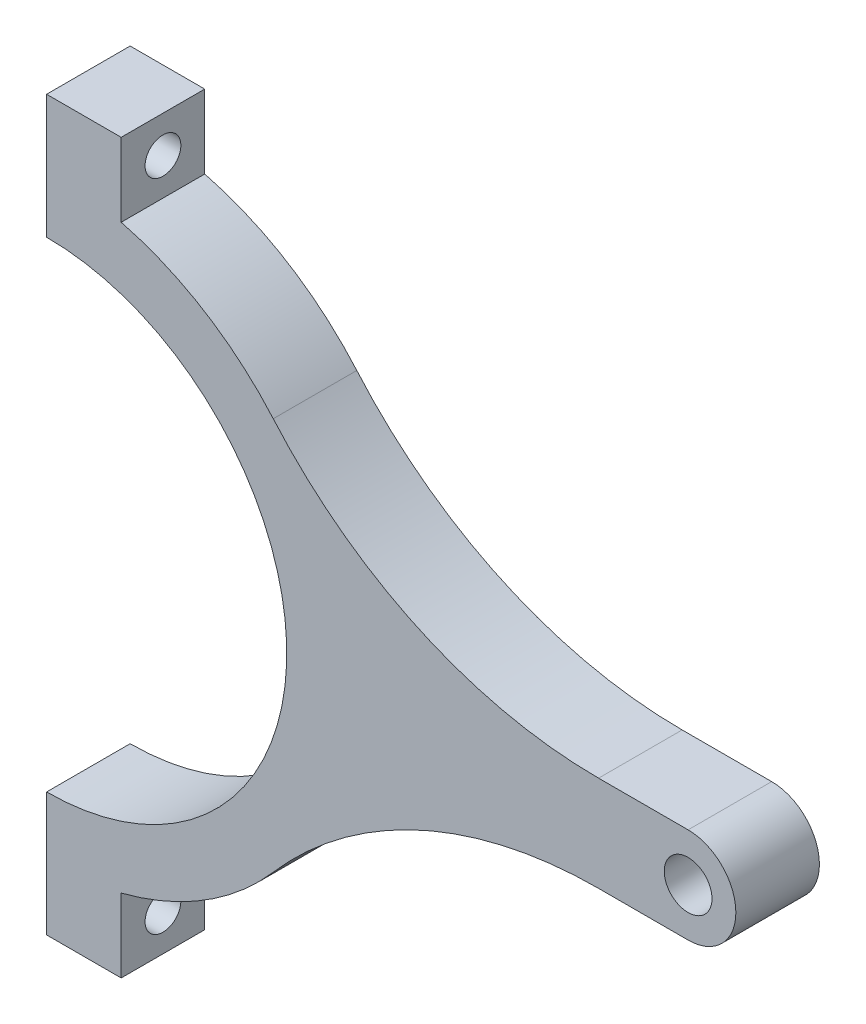
ISO-10303-21;
HEADER;
FILE_DESCRIPTION(('STEP AP214'),'2;1');
FILE_NAME('part.step','',(''),(''),'','','');
FILE_SCHEMA(('AUTOMOTIVE_DESIGN { 1 0 10303 214 1 1 1 1 }'));
ENDSEC;
DATA;
#1=APPLICATION_CONTEXT('core data for automotive mechanical design processes');
#2=APPLICATION_PROTOCOL_DEFINITION('international standard','automotive_design',2000,#1);
#3=PRODUCT_CONTEXT('',#1,'mechanical');
#4=PRODUCT('Part','Part','',(#3));
#5=PRODUCT_RELATED_PRODUCT_CATEGORY('part','',(#4));
#6=PRODUCT_DEFINITION_FORMATION('','',#4);
#7=PRODUCT_DEFINITION_CONTEXT('part definition',#1,'design');
#8=PRODUCT_DEFINITION('design','',#6,#7);
#9=PRODUCT_DEFINITION_SHAPE('','',#8);
#10=(LENGTH_UNIT() NAMED_UNIT(*) SI_UNIT(.MILLI.,.METRE.));
#11=(NAMED_UNIT(*) PLANE_ANGLE_UNIT() SI_UNIT($,.RADIAN.));
#12=(NAMED_UNIT(*) SI_UNIT($,.STERADIAN.) SOLID_ANGLE_UNIT());
#13=UNCERTAINTY_MEASURE_WITH_UNIT(LENGTH_MEASURE(1.E-05),#10,'distance_accuracy_value','');
#14=(GEOMETRIC_REPRESENTATION_CONTEXT(3) GLOBAL_UNCERTAINTY_ASSIGNED_CONTEXT((#13)) GLOBAL_UNIT_ASSIGNED_CONTEXT((#10,
#11,#12)) REPRESENTATION_CONTEXT('',''));
#15=CARTESIAN_POINT('',(0.,0.,0.));
#16=DIRECTION('',(0.,0.,1.));
#17=DIRECTION('',(1.,0.,0.));
#18=AXIS2_PLACEMENT_3D('',#15,#16,#17);
#19=CARTESIAN_POINT('',(0.,0.,28.));
#20=DIRECTION('',(0.,0.,-1.));
#21=DIRECTION('',(-1.,0.,0.));
#22=AXIS2_PLACEMENT_3D('',#19,#20,#21);
#23=PLANE('',#22);
#24=CARTESIAN_POINT('',(0.,0.,28.));
#25=DIRECTION('',(0.,0.,-1.));
#26=DIRECTION('',(-1.,0.,0.));
#27=AXIS2_PLACEMENT_3D('',#24,#25,#26);
#28=CIRCLE('',#27,80.5);
#29=CARTESIAN_POINT('',(0.,80.5,28.));
#30=VERTEX_POINT('',#29);
#31=CARTESIAN_POINT('',(0.,-80.5,28.));
#32=VERTEX_POINT('',#31);
#33=EDGE_CURVE('E197',#30,#32,#28,.T.);
#34=ORIENTED_EDGE('',*,*,#33,.T.);
#35=DIRECTION('',(0.,-1.,0.));
#36=VECTOR('',#35,1.);
#37=CARTESIAN_POINT('',(0.,-122.,28.));
#38=LINE('',#37,#36);
#39=CARTESIAN_POINT('',(0.,-122.,28.));
#40=VERTEX_POINT('',#39);
#41=EDGE_CURVE('E115',#32,#40,#38,.T.);
#42=ORIENTED_EDGE('',*,*,#41,.T.);
#43=DIRECTION('',(1.,0.,0.));
#44=VECTOR('',#43,1.);
#45=CARTESIAN_POINT('',(0.,-122.,28.));
#46=LINE('',#45,#44);
#47=CARTESIAN_POINT('',(25.,-122.,28.));
#48=VERTEX_POINT('',#47);
#49=EDGE_CURVE('E231',#40,#48,#46,.T.);
#50=ORIENTED_EDGE('',*,*,#49,.T.);
#51=DIRECTION('',(0.,1.,0.));
#52=VECTOR('',#51,1.);
#53=CARTESIAN_POINT('',(25.,-122.,28.));
#54=LINE('',#53,#52);
#55=CARTESIAN_POINT('',(25.,-97.3408958249306,28.));
#56=VERTEX_POINT('',#55);
#57=EDGE_CURVE('E250',#48,#56,#54,.T.);
#58=ORIENTED_EDGE('',*,*,#57,.T.);
#59=CARTESIAN_POINT('',(0.,0.,28.));
#60=DIRECTION('',(0.,0.,1.));
#61=DIRECTION('',(-1.,0.,0.));
#62=AXIS2_PLACEMENT_3D('',#59,#60,#61);
#63=CIRCLE('',#62,100.5);
#64=CARTESIAN_POINT('',(75.9606795559074,-65.8044463650045,28.));
#65=VERTEX_POINT('',#64);
#66=EDGE_CURVE('E247',#56,#65,#63,.T.);
#67=ORIENTED_EDGE('',*,*,#66,.T.);
#68=CARTESIAN_POINT('',(185.,-160.264792899408,28.));
#69=DIRECTION('',(0.,0.,-1.));
#70=DIRECTION('',(-1.,0.,0.));
#71=AXIS2_PLACEMENT_3D('',#68,#69,#70);
#72=CIRCLE('',#71,144.264792899408);
#73=CARTESIAN_POINT('',(185.,-16.,28.));
#74=VERTEX_POINT('',#73);
#75=EDGE_CURVE('E249',#65,#74,#72,.T.);
#76=ORIENTED_EDGE('',*,*,#75,.T.);
#77=DIRECTION('',(1.,0.,0.));
#78=VECTOR('',#77,1.);
#79=CARTESIAN_POINT('',(215.,-16.,28.));
#80=LINE('',#79,#78);
#81=CARTESIAN_POINT('',(215.,-16.,28.));
#82=VERTEX_POINT('',#81);
#83=EDGE_CURVE('E252',#74,#82,#80,.T.);
#84=ORIENTED_EDGE('',*,*,#83,.T.);
#85=CARTESIAN_POINT('',(215.,0.,28.));
#86=DIRECTION('',(0.,0.,1.));
#87=DIRECTION('',(1.,0.,0.));
#88=AXIS2_PLACEMENT_3D('',#85,#86,#87);
#89=CIRCLE('',#88,16.);
#90=CARTESIAN_POINT('',(215.,16.,28.));
#91=VERTEX_POINT('',#90);
#92=EDGE_CURVE('E258',#82,#91,#89,.T.);
#93=ORIENTED_EDGE('',*,*,#92,.T.);
#94=DIRECTION('',(-1.,0.,0.));
#95=VECTOR('',#94,1.);
#96=CARTESIAN_POINT('',(215.,16.,28.));
#97=LINE('',#96,#95);
#98=CARTESIAN_POINT('',(185.,16.,28.));
#99=VERTEX_POINT('',#98);
#100=EDGE_CURVE('E260',#91,#99,#97,.T.);
#101=ORIENTED_EDGE('',*,*,#100,.T.);
#102=CARTESIAN_POINT('',(185.,160.264792899408,28.));
#103=DIRECTION('',(0.,0.,-1.));
#104=DIRECTION('',(1.,0.,0.));
#105=AXIS2_PLACEMENT_3D('',#102,#103,#104);
#106=CIRCLE('',#105,144.264792899408);
#107=CARTESIAN_POINT('',(75.9606795559074,65.8044463650045,28.));
#108=VERTEX_POINT('',#107);
#109=EDGE_CURVE('E262',#99,#108,#106,.T.);
#110=ORIENTED_EDGE('',*,*,#109,.T.);
#111=CARTESIAN_POINT('',(0.,0.,28.));
#112=DIRECTION('',(0.,0.,1.));
#113=DIRECTION('',(-1.,0.,0.));
#114=AXIS2_PLACEMENT_3D('',#111,#112,#113);
#115=CIRCLE('',#114,100.5);
#116=CARTESIAN_POINT('',(25.,97.3408958249307,28.));
#117=VERTEX_POINT('',#116);
#118=EDGE_CURVE('E152',#108,#117,#115,.T.);
#119=ORIENTED_EDGE('',*,*,#118,.T.);
#120=DIRECTION('',(0.,1.,0.));
#121=VECTOR('',#120,1.);
#122=CARTESIAN_POINT('',(25.,122.,28.));
#123=LINE('',#122,#121);
#124=CARTESIAN_POINT('',(25.,122.,28.));
#125=VERTEX_POINT('',#124);
#126=EDGE_CURVE('E146',#117,#125,#123,.T.);
#127=ORIENTED_EDGE('',*,*,#126,.T.);
#128=DIRECTION('',(-1.,0.,0.));
#129=VECTOR('',#128,1.);
#130=CARTESIAN_POINT('',(0.,122.,28.));
#131=LINE('',#130,#129);
#132=CARTESIAN_POINT('',(0.,122.,28.));
#133=VERTEX_POINT('',#132);
#134=EDGE_CURVE('E150',#125,#133,#131,.T.);
#135=ORIENTED_EDGE('',*,*,#134,.T.);
#136=DIRECTION('',(0.,-1.,0.));
#137=VECTOR('',#136,1.);
#138=CARTESIAN_POINT('',(0.,80.5,28.));
#139=LINE('',#138,#137);
#140=EDGE_CURVE('E54',#133,#30,#139,.T.);
#141=ORIENTED_EDGE('',*,*,#140,.T.);
#142=EDGE_LOOP('',(#34,#42,#50,#58,#67,#76,#84,#93,#101,#110,#119,#127,#135,#141));
#143=FACE_BOUND('',#142,.T.);
#144=CARTESIAN_POINT('',(215.,0.,28.));
#145=DIRECTION('',(0.,0.,1.));
#146=DIRECTION('',(1.,0.,0.));
#147=AXIS2_PLACEMENT_3D('',#144,#145,#146);
#148=CIRCLE('',#147,8.00000000000001);
#149=CARTESIAN_POINT('',(223.,0.,28.));
#150=VERTEX_POINT('',#149);
#151=EDGE_CURVE('E174',#150,#150,#148,.T.);
#152=ORIENTED_EDGE('',*,*,#151,.F.);
#153=EDGE_LOOP('',(#152));
#154=FACE_BOUND('',#153,.T.);
#155=ADVANCED_FACE('F36',(#143,#154),#23,.F.);
#156=CARTESIAN_POINT('',(0.,0.,0.));
#157=DIRECTION('',(0.,0.,-1.));
#158=DIRECTION('',(-1.,0.,0.));
#159=AXIS2_PLACEMENT_3D('',#156,#157,#158);
#160=PLANE('',#159);
#161=CARTESIAN_POINT('',(0.,0.,0.));
#162=DIRECTION('',(0.,0.,-1.));
#163=DIRECTION('',(-1.,0.,0.));
#164=AXIS2_PLACEMENT_3D('',#161,#162,#163);
#165=CIRCLE('',#164,80.5);
#166=CARTESIAN_POINT('',(0.,80.5,0.));
#167=VERTEX_POINT('',#166);
#168=CARTESIAN_POINT('',(0.,-80.5,0.));
#169=VERTEX_POINT('',#168);
#170=EDGE_CURVE('E170',#167,#169,#165,.T.);
#171=ORIENTED_EDGE('',*,*,#170,.F.);
#172=DIRECTION('',(0.,-1.,0.));
#173=VECTOR('',#172,1.);
#174=CARTESIAN_POINT('',(0.,80.5,0.));
#175=LINE('',#174,#173);
#176=CARTESIAN_POINT('',(0.,122.,0.));
#177=VERTEX_POINT('',#176);
#178=EDGE_CURVE('E107',#177,#167,#175,.T.);
#179=ORIENTED_EDGE('',*,*,#178,.F.);
#180=DIRECTION('',(-1.,0.,0.));
#181=VECTOR('',#180,1.);
#182=CARTESIAN_POINT('',(0.,122.,0.));
#183=LINE('',#182,#181);
#184=CARTESIAN_POINT('',(25.,122.,0.));
#185=VERTEX_POINT('',#184);
#186=EDGE_CURVE('E101',#185,#177,#183,.T.);
#187=ORIENTED_EDGE('',*,*,#186,.F.);
#188=DIRECTION('',(0.,1.,0.));
#189=VECTOR('',#188,1.);
#190=CARTESIAN_POINT('',(25.,122.,0.));
#191=LINE('',#190,#189);
#192=CARTESIAN_POINT('',(25.,97.3408958249307,0.));
#193=VERTEX_POINT('',#192);
#194=EDGE_CURVE('E160',#193,#185,#191,.T.);
#195=ORIENTED_EDGE('',*,*,#194,.F.);
#196=CARTESIAN_POINT('',(0.,0.,0.));
#197=DIRECTION('',(0.,0.,1.));
#198=DIRECTION('',(-1.,0.,0.));
#199=AXIS2_PLACEMENT_3D('',#196,#197,#198);
#200=CIRCLE('',#199,100.5);
#201=CARTESIAN_POINT('',(75.9606795559074,65.8044463650045,0.));
#202=VERTEX_POINT('',#201);
#203=EDGE_CURVE('E192',#202,#193,#200,.T.);
#204=ORIENTED_EDGE('',*,*,#203,.F.);
#205=CARTESIAN_POINT('',(185.,160.264792899408,0.));
#206=DIRECTION('',(0.,0.,-1.));
#207=DIRECTION('',(1.,0.,0.));
#208=AXIS2_PLACEMENT_3D('',#205,#206,#207);
#209=CIRCLE('',#208,144.264792899408);
#210=CARTESIAN_POINT('',(185.,16.,0.));
#211=VERTEX_POINT('',#210);
#212=EDGE_CURVE('E190',#211,#202,#209,.T.);
#213=ORIENTED_EDGE('',*,*,#212,.F.);
#214=DIRECTION('',(-1.,0.,0.));
#215=VECTOR('',#214,1.);
#216=CARTESIAN_POINT('',(215.,16.,0.));
#217=LINE('',#216,#215);
#218=CARTESIAN_POINT('',(215.,16.,0.));
#219=VERTEX_POINT('',#218);
#220=EDGE_CURVE('E188',#219,#211,#217,.T.);
#221=ORIENTED_EDGE('',*,*,#220,.F.);
#222=CARTESIAN_POINT('',(215.,0.,0.));
#223=DIRECTION('',(0.,0.,1.));
#224=DIRECTION('',(1.,0.,0.));
#225=AXIS2_PLACEMENT_3D('',#222,#223,#224);
#226=CIRCLE('',#225,16.);
#227=CARTESIAN_POINT('',(215.,-16.,0.));
#228=VERTEX_POINT('',#227);
#229=EDGE_CURVE('E186',#228,#219,#226,.T.);
#230=ORIENTED_EDGE('',*,*,#229,.F.);
#231=DIRECTION('',(1.,0.,0.));
#232=VECTOR('',#231,1.);
#233=CARTESIAN_POINT('',(215.,-16.,0.));
#234=LINE('',#233,#232);
#235=CARTESIAN_POINT('',(185.,-16.,0.));
#236=VERTEX_POINT('',#235);
#237=EDGE_CURVE('E184',#236,#228,#234,.T.);
#238=ORIENTED_EDGE('',*,*,#237,.F.);
#239=CARTESIAN_POINT('',(185.,-160.264792899408,0.));
#240=DIRECTION('',(0.,0.,-1.));
#241=DIRECTION('',(-1.,0.,0.));
#242=AXIS2_PLACEMENT_3D('',#239,#240,#241);
#243=CIRCLE('',#242,144.264792899408);
#244=CARTESIAN_POINT('',(75.9606795559074,-65.8044463650045,0.));
#245=VERTEX_POINT('',#244);
#246=EDGE_CURVE('E182',#245,#236,#243,.T.);
#247=ORIENTED_EDGE('',*,*,#246,.F.);
#248=CARTESIAN_POINT('',(0.,0.,0.));
#249=DIRECTION('',(0.,0.,1.));
#250=DIRECTION('',(-1.,0.,0.));
#251=AXIS2_PLACEMENT_3D('',#248,#249,#250);
#252=CIRCLE('',#251,100.5);
#253=CARTESIAN_POINT('',(25.,-97.3408958249306,0.));
#254=VERTEX_POINT('',#253);
#255=EDGE_CURVE('E180',#254,#245,#252,.T.);
#256=ORIENTED_EDGE('',*,*,#255,.F.);
#257=DIRECTION('',(0.,1.,0.));
#258=VECTOR('',#257,1.);
#259=CARTESIAN_POINT('',(25.,-122.,0.));
#260=LINE('',#259,#258);
#261=CARTESIAN_POINT('',(25.,-122.,0.));
#262=VERTEX_POINT('',#261);
#263=EDGE_CURVE('E178',#262,#254,#260,.T.);
#264=ORIENTED_EDGE('',*,*,#263,.F.);
#265=DIRECTION('',(1.,0.,0.));
#266=VECTOR('',#265,1.);
#267=CARTESIAN_POINT('',(0.,-122.,0.));
#268=LINE('',#267,#266);
#269=CARTESIAN_POINT('',(0.,-122.,0.));
#270=VERTEX_POINT('',#269);
#271=EDGE_CURVE('E176',#270,#262,#268,.T.);
#272=ORIENTED_EDGE('',*,*,#271,.F.);
#273=DIRECTION('',(0.,-1.,0.));
#274=VECTOR('',#273,1.);
#275=CARTESIAN_POINT('',(0.,-122.,0.));
#276=LINE('',#275,#274);
#277=EDGE_CURVE('E173',#169,#270,#276,.T.);
#278=ORIENTED_EDGE('',*,*,#277,.F.);
#279=EDGE_LOOP('',(#171,#179,#187,#195,#204,#213,#221,#230,#238,#247,#256,#264,#272,#278));
#280=FACE_BOUND('',#279,.T.);
#281=CARTESIAN_POINT('',(215.,0.,0.));
#282=DIRECTION('',(0.,0.,1.));
#283=DIRECTION('',(1.,0.,0.));
#284=AXIS2_PLACEMENT_3D('',#281,#282,#283);
#285=CIRCLE('',#284,8.00000000000001);
#286=CARTESIAN_POINT('',(223.,0.,0.));
#287=VERTEX_POINT('',#286);
#288=EDGE_CURVE('E314',#287,#287,#285,.T.);
#289=ORIENTED_EDGE('',*,*,#288,.T.);
#290=EDGE_LOOP('',(#289));
#291=FACE_BOUND('',#290,.T.);
#292=ADVANCED_FACE('F235',(#280,#291),#160,.T.);
#293=CARTESIAN_POINT('',(0.,0.,28.));
#294=DIRECTION('',(0.,0.,-1.));
#295=DIRECTION('',(-1.,0.,0.));
#296=AXIS2_PLACEMENT_3D('',#293,#294,#295);
#297=CYLINDRICAL_SURFACE('',#296,80.5);
#298=ORIENTED_EDGE('',*,*,#170,.T.);
#299=DIRECTION('',(0.,0.,-1.));
#300=VECTOR('',#299,1.);
#301=CARTESIAN_POINT('',(0.,-80.5,28.));
#302=LINE('',#301,#300);
#303=EDGE_CURVE('E11',#32,#169,#302,.T.);
#304=ORIENTED_EDGE('',*,*,#303,.F.);
#305=ORIENTED_EDGE('',*,*,#33,.F.);
#306=DIRECTION('',(0.,0.,-1.));
#307=VECTOR('',#306,1.);
#308=CARTESIAN_POINT('',(0.,80.5,28.));
#309=LINE('',#308,#307);
#310=EDGE_CURVE('E166',#30,#167,#309,.T.);
#311=ORIENTED_EDGE('',*,*,#310,.T.);
#312=EDGE_LOOP('',(#298,#304,#305,#311));
#313=FACE_BOUND('',#312,.T.);
#314=ADVANCED_FACE('F38',(#313),#297,.F.);
#315=CARTESIAN_POINT('',(0.,-122.,28.));
#316=DIRECTION('',(1.,0.,0.));
#317=DIRECTION('',(0.,0.,-1.));
#318=AXIS2_PLACEMENT_3D('',#315,#316,#317);
#319=PLANE('',#318);
#320=CARTESIAN_POINT('',(0.,-109.7,14.));
#321=DIRECTION('',(-1.,0.,0.));
#322=DIRECTION('',(0.,0.,1.));
#323=AXIS2_PLACEMENT_3D('',#320,#321,#322);
#324=CIRCLE('',#323,6.);
#325=CARTESIAN_POINT('',(0.,-109.7,20.));
#326=VERTEX_POINT('',#325);
#327=EDGE_CURVE('E315',#326,#326,#324,.T.);
#328=ORIENTED_EDGE('',*,*,#327,.F.);
#329=EDGE_LOOP('',(#328));
#330=FACE_BOUND('',#329,.T.);
#331=ORIENTED_EDGE('',*,*,#277,.T.);
#332=DIRECTION('',(0.,0.,-1.));
#333=VECTOR('',#332,1.);
#334=CARTESIAN_POINT('',(0.,-122.,28.));
#335=LINE('',#334,#333);
#336=EDGE_CURVE('E46',#40,#270,#335,.T.);
#337=ORIENTED_EDGE('',*,*,#336,.F.);
#338=ORIENTED_EDGE('',*,*,#41,.F.);
#339=ORIENTED_EDGE('',*,*,#303,.T.);
#340=EDGE_LOOP('',(#331,#337,#338,#339));
#341=FACE_BOUND('',#340,.T.);
#342=ADVANCED_FACE('F331',(#330,#341),#319,.F.);
#343=CARTESIAN_POINT('',(0.,-122.,28.));
#344=DIRECTION('',(0.,1.,0.));
#345=DIRECTION('',(0.,0.,1.));
#346=AXIS2_PLACEMENT_3D('',#343,#344,#345);
#347=PLANE('',#346);
#348=ORIENTED_EDGE('',*,*,#271,.T.);
#349=DIRECTION('',(0.,0.,-1.));
#350=VECTOR('',#349,1.);
#351=CARTESIAN_POINT('',(25.,-122.,28.));
#352=LINE('',#351,#350);
#353=EDGE_CURVE('E222',#48,#262,#352,.T.);
#354=ORIENTED_EDGE('',*,*,#353,.F.);
#355=ORIENTED_EDGE('',*,*,#49,.F.);
#356=ORIENTED_EDGE('',*,*,#336,.T.);
#357=EDGE_LOOP('',(#348,#354,#355,#356));
#358=FACE_BOUND('',#357,.T.);
#359=ADVANCED_FACE('F229',(#358),#347,.F.);
#360=CARTESIAN_POINT('',(25.,-122.,28.));
#361=DIRECTION('',(-1.,0.,0.));
#362=DIRECTION('',(0.,0.,1.));
#363=AXIS2_PLACEMENT_3D('',#360,#361,#362);
#364=PLANE('',#363);
#365=CARTESIAN_POINT('',(25.,-109.7,14.));
#366=DIRECTION('',(-1.,0.,0.));
#367=DIRECTION('',(0.,0.,1.));
#368=AXIS2_PLACEMENT_3D('',#365,#366,#367);
#369=CIRCLE('',#368,6.);
#370=CARTESIAN_POINT('',(25.,-109.7,20.));
#371=VERTEX_POINT('',#370);
#372=EDGE_CURVE('E40',#371,#371,#369,.T.);
#373=ORIENTED_EDGE('',*,*,#372,.T.);
#374=EDGE_LOOP('',(#373));
#375=FACE_BOUND('',#374,.T.);
#376=ORIENTED_EDGE('',*,*,#263,.T.);
#377=DIRECTION('',(0.,0.,-1.));
#378=VECTOR('',#377,1.);
#379=CARTESIAN_POINT('',(25.,-97.3408958249306,28.));
#380=LINE('',#379,#378);
#381=EDGE_CURVE('E219',#56,#254,#380,.T.);
#382=ORIENTED_EDGE('',*,*,#381,.F.);
#383=ORIENTED_EDGE('',*,*,#57,.F.);
#384=ORIENTED_EDGE('',*,*,#353,.T.);
#385=EDGE_LOOP('',(#376,#382,#383,#384));
#386=FACE_BOUND('',#385,.T.);
#387=ADVANCED_FACE('F241',(#375,#386),#364,.F.);
#388=CARTESIAN_POINT('',(0.,0.,28.));
#389=DIRECTION('',(0.,0.,-1.));
#390=DIRECTION('',(-1.,0.,0.));
#391=AXIS2_PLACEMENT_3D('',#388,#389,#390);
#392=CYLINDRICAL_SURFACE('',#391,100.5);
#393=ORIENTED_EDGE('',*,*,#255,.T.);
#394=DIRECTION('',(0.,0.,-1.));
#395=VECTOR('',#394,1.);
#396=CARTESIAN_POINT('',(75.9606795559074,-65.8044463650045,28.));
#397=LINE('',#396,#395);
#398=EDGE_CURVE('E216',#65,#245,#397,.T.);
#399=ORIENTED_EDGE('',*,*,#398,.F.);
#400=ORIENTED_EDGE('',*,*,#66,.F.);
#401=ORIENTED_EDGE('',*,*,#381,.T.);
#402=EDGE_LOOP('',(#393,#399,#400,#401));
#403=FACE_BOUND('',#402,.T.);
#404=ADVANCED_FACE('F245',(#403),#392,.T.);
#405=CARTESIAN_POINT('',(185.,-160.264792899408,28.));
#406=DIRECTION('',(0.,0.,-1.));
#407=DIRECTION('',(-1.,0.,0.));
#408=AXIS2_PLACEMENT_3D('',#405,#406,#407);
#409=CYLINDRICAL_SURFACE('',#408,144.264792899408);
#410=ORIENTED_EDGE('',*,*,#246,.T.);
#411=DIRECTION('',(0.,0.,-1.));
#412=VECTOR('',#411,1.);
#413=CARTESIAN_POINT('',(185.,-16.,28.));
#414=LINE('',#413,#412);
#415=EDGE_CURVE('E213',#74,#236,#414,.T.);
#416=ORIENTED_EDGE('',*,*,#415,.F.);
#417=ORIENTED_EDGE('',*,*,#75,.F.);
#418=ORIENTED_EDGE('',*,*,#398,.T.);
#419=EDGE_LOOP('',(#410,#416,#417,#418));
#420=FACE_BOUND('',#419,.T.);
#421=ADVANCED_FACE('F344',(#420),#409,.F.);
#422=CARTESIAN_POINT('',(215.,-16.,28.));
#423=DIRECTION('',(0.,1.,0.));
#424=DIRECTION('',(-1.,0.,0.));
#425=AXIS2_PLACEMENT_3D('',#422,#423,#424);
#426=PLANE('',#425);
#427=ORIENTED_EDGE('',*,*,#237,.T.);
#428=DIRECTION('',(0.,0.,-1.));
#429=VECTOR('',#428,1.);
#430=CARTESIAN_POINT('',(215.,-16.,28.));
#431=LINE('',#430,#429);
#432=EDGE_CURVE('E210',#82,#228,#431,.T.);
#433=ORIENTED_EDGE('',*,*,#432,.F.);
#434=ORIENTED_EDGE('',*,*,#83,.F.);
#435=ORIENTED_EDGE('',*,*,#415,.T.);
#436=EDGE_LOOP('',(#427,#433,#434,#435));
#437=FACE_BOUND('',#436,.T.);
#438=ADVANCED_FACE('F347',(#437),#426,.F.);
#439=CARTESIAN_POINT('',(215.,0.,28.));
#440=DIRECTION('',(0.,0.,-1.));
#441=DIRECTION('',(-1.,0.,0.));
#442=AXIS2_PLACEMENT_3D('',#439,#440,#441);
#443=CYLINDRICAL_SURFACE('',#442,16.);
#444=ORIENTED_EDGE('',*,*,#229,.T.);
#445=DIRECTION('',(0.,0.,-1.));
#446=VECTOR('',#445,1.);
#447=CARTESIAN_POINT('',(215.,16.,28.));
#448=LINE('',#447,#446);
#449=EDGE_CURVE('E207',#91,#219,#448,.T.);
#450=ORIENTED_EDGE('',*,*,#449,.F.);
#451=ORIENTED_EDGE('',*,*,#92,.F.);
#452=ORIENTED_EDGE('',*,*,#432,.T.);
#453=EDGE_LOOP('',(#444,#450,#451,#452));
#454=FACE_BOUND('',#453,.T.);
#455=ADVANCED_FACE('F351',(#454),#443,.T.);
#456=CARTESIAN_POINT('',(215.,16.,28.));
#457=DIRECTION('',(0.,-1.,0.));
#458=DIRECTION('',(1.,0.,0.));
#459=AXIS2_PLACEMENT_3D('',#456,#457,#458);
#460=PLANE('',#459);
#461=ORIENTED_EDGE('',*,*,#220,.T.);
#462=DIRECTION('',(0.,0.,-1.));
#463=VECTOR('',#462,1.);
#464=CARTESIAN_POINT('',(185.,16.,28.));
#465=LINE('',#464,#463);
#466=EDGE_CURVE('E204',#99,#211,#465,.T.);
#467=ORIENTED_EDGE('',*,*,#466,.F.);
#468=ORIENTED_EDGE('',*,*,#100,.F.);
#469=ORIENTED_EDGE('',*,*,#449,.T.);
#470=EDGE_LOOP('',(#461,#467,#468,#469));
#471=FACE_BOUND('',#470,.T.);
#472=ADVANCED_FACE('F355',(#471),#460,.F.);
#473=CARTESIAN_POINT('',(185.,160.264792899408,28.));
#474=DIRECTION('',(0.,0.,-1.));
#475=DIRECTION('',(-1.,0.,0.));
#476=AXIS2_PLACEMENT_3D('',#473,#474,#475);
#477=CYLINDRICAL_SURFACE('',#476,144.264792899408);
#478=ORIENTED_EDGE('',*,*,#212,.T.);
#479=DIRECTION('',(0.,0.,-1.));
#480=VECTOR('',#479,1.);
#481=CARTESIAN_POINT('',(75.9606795559074,65.8044463650045,28.));
#482=LINE('',#481,#480);
#483=EDGE_CURVE('E201',#108,#202,#482,.T.);
#484=ORIENTED_EDGE('',*,*,#483,.F.);
#485=ORIENTED_EDGE('',*,*,#109,.F.);
#486=ORIENTED_EDGE('',*,*,#466,.T.);
#487=EDGE_LOOP('',(#478,#484,#485,#486));
#488=FACE_BOUND('',#487,.T.);
#489=ADVANCED_FACE('F268',(#488),#477,.F.);
#490=CARTESIAN_POINT('',(0.,0.,28.));
#491=DIRECTION('',(0.,0.,-1.));
#492=DIRECTION('',(-1.,0.,0.));
#493=AXIS2_PLACEMENT_3D('',#490,#491,#492);
#494=CYLINDRICAL_SURFACE('',#493,100.5);
#495=ORIENTED_EDGE('',*,*,#203,.T.);
#496=DIRECTION('',(0.,0.,-1.));
#497=VECTOR('',#496,1.);
#498=CARTESIAN_POINT('',(25.,97.3408958249307,28.));
#499=LINE('',#498,#497);
#500=EDGE_CURVE('E161',#117,#193,#499,.T.);
#501=ORIENTED_EDGE('',*,*,#500,.F.);
#502=ORIENTED_EDGE('',*,*,#118,.F.);
#503=ORIENTED_EDGE('',*,*,#483,.T.);
#504=EDGE_LOOP('',(#495,#501,#502,#503));
#505=FACE_BOUND('',#504,.T.);
#506=ADVANCED_FACE('F272',(#505),#494,.T.);
#507=CARTESIAN_POINT('',(25.,122.,28.));
#508=DIRECTION('',(-1.,0.,0.));
#509=DIRECTION('',(0.,-1.,0.));
#510=AXIS2_PLACEMENT_3D('',#507,#508,#509);
#511=PLANE('',#510);
#512=CARTESIAN_POINT('',(25.,109.7,14.));
#513=DIRECTION('',(-1.,0.,0.));
#514=DIRECTION('',(0.,-1.,0.));
#515=AXIS2_PLACEMENT_3D('',#512,#513,#514);
#516=CIRCLE('',#515,6.00000000000001);
#517=CARTESIAN_POINT('',(25.,103.7,14.));
#518=VERTEX_POINT('',#517);
#519=EDGE_CURVE('E310',#518,#518,#516,.T.);
#520=ORIENTED_EDGE('',*,*,#519,.T.);
#521=EDGE_LOOP('',(#520));
#522=FACE_BOUND('',#521,.T.);
#523=ORIENTED_EDGE('',*,*,#194,.T.);
#524=DIRECTION('',(0.,0.,-1.));
#525=VECTOR('',#524,1.);
#526=CARTESIAN_POINT('',(25.,122.,28.));
#527=LINE('',#526,#525);
#528=EDGE_CURVE('E157',#125,#185,#527,.T.);
#529=ORIENTED_EDGE('',*,*,#528,.F.);
#530=ORIENTED_EDGE('',*,*,#126,.F.);
#531=ORIENTED_EDGE('',*,*,#500,.T.);
#532=EDGE_LOOP('',(#523,#529,#530,#531));
#533=FACE_BOUND('',#532,.T.);
#534=ADVANCED_FACE('F158',(#522,#533),#511,.F.);
#535=CARTESIAN_POINT('',(0.,122.,28.));
#536=DIRECTION('',(0.,-1.,0.));
#537=DIRECTION('',(0.,0.,-1.));
#538=AXIS2_PLACEMENT_3D('',#535,#536,#537);
#539=PLANE('',#538);
#540=ORIENTED_EDGE('',*,*,#186,.T.);
#541=DIRECTION('',(0.,0.,-1.));
#542=VECTOR('',#541,1.);
#543=CARTESIAN_POINT('',(0.,122.,28.));
#544=LINE('',#543,#542);
#545=EDGE_CURVE('E162',#133,#177,#544,.T.);
#546=ORIENTED_EDGE('',*,*,#545,.F.);
#547=ORIENTED_EDGE('',*,*,#134,.F.);
#548=ORIENTED_EDGE('',*,*,#528,.T.);
#549=EDGE_LOOP('',(#540,#546,#547,#548));
#550=FACE_BOUND('',#549,.T.);
#551=ADVANCED_FACE('F164',(#550),#539,.F.);
#552=CARTESIAN_POINT('',(0.,80.5,28.));
#553=DIRECTION('',(1.,0.,0.));
#554=DIRECTION('',(0.,0.,-1.));
#555=AXIS2_PLACEMENT_3D('',#552,#553,#554);
#556=PLANE('',#555);
#557=CARTESIAN_POINT('',(0.,109.7,14.));
#558=DIRECTION('',(-1.,0.,0.));
#559=DIRECTION('',(0.,0.,1.));
#560=AXIS2_PLACEMENT_3D('',#557,#558,#559);
#561=CIRCLE('',#560,6.00000000000001);
#562=CARTESIAN_POINT('',(0.,109.7,20.));
#563=VERTEX_POINT('',#562);
#564=EDGE_CURVE('E307',#563,#563,#561,.T.);
#565=ORIENTED_EDGE('',*,*,#564,.F.);
#566=EDGE_LOOP('',(#565));
#567=FACE_BOUND('',#566,.T.);
#568=ORIENTED_EDGE('',*,*,#178,.T.);
#569=ORIENTED_EDGE('',*,*,#310,.F.);
#570=ORIENTED_EDGE('',*,*,#140,.F.);
#571=ORIENTED_EDGE('',*,*,#545,.T.);
#572=EDGE_LOOP('',(#568,#569,#570,#571));
#573=FACE_BOUND('',#572,.T.);
#574=ADVANCED_FACE('F276',(#567,#573),#556,.F.);
#575=CARTESIAN_POINT('',(215.,0.,28.));
#576=DIRECTION('',(0.,0.,-1.));
#577=DIRECTION('',(-1.,0.,0.));
#578=AXIS2_PLACEMENT_3D('',#575,#576,#577);
#579=CYLINDRICAL_SURFACE('',#578,8.00000000000001);
#580=ORIENTED_EDGE('',*,*,#151,.T.);
#581=EDGE_LOOP('',(#580));
#582=FACE_BOUND('',#581,.T.);
#583=ORIENTED_EDGE('',*,*,#288,.F.);
#584=EDGE_LOOP('',(#583));
#585=FACE_BOUND('',#584,.T.);
#586=ADVANCED_FACE('F278',(#582,#585),#579,.F.);
#587=CARTESIAN_POINT('',(28.,109.7,14.));
#588=DIRECTION('',(-1.,0.,0.));
#589=DIRECTION('',(0.,0.,1.));
#590=AXIS2_PLACEMENT_3D('',#587,#588,#589);
#591=CYLINDRICAL_SURFACE('',#590,6.00000000000001);
#592=ORIENTED_EDGE('',*,*,#564,.T.);
#593=EDGE_LOOP('',(#592));
#594=FACE_BOUND('',#593,.T.);
#595=ORIENTED_EDGE('',*,*,#519,.F.);
#596=EDGE_LOOP('',(#595));
#597=FACE_BOUND('',#596,.T.);
#598=ADVANCED_FACE('F285',(#594,#597),#591,.F.);
#599=CARTESIAN_POINT('',(28.,-109.7,14.));
#600=DIRECTION('',(-1.,0.,0.));
#601=DIRECTION('',(0.,0.,1.));
#602=AXIS2_PLACEMENT_3D('',#599,#600,#601);
#603=CYLINDRICAL_SURFACE('',#602,6.);
#604=ORIENTED_EDGE('',*,*,#327,.T.);
#605=EDGE_LOOP('',(#604));
#606=FACE_BOUND('',#605,.T.);
#607=ORIENTED_EDGE('',*,*,#372,.F.);
#608=EDGE_LOOP('',(#607));
#609=FACE_BOUND('',#608,.T.);
#610=ADVANCED_FACE('F297',(#606,#609),#603,.F.);
#611=CLOSED_SHELL('',(#155,#292,#314,#342,#359,#387,#404,#421,#438,#455,#472,#489,#506,#534,
#551,#574,#586,#598,#610));
#612=MANIFOLD_SOLID_BREP('B2',#611);
#613=ADVANCED_BREP_SHAPE_REPRESENTATION('',(#18,#612),#14);
#614=SHAPE_DEFINITION_REPRESENTATION(#9,#613);
ENDSEC;
END-ISO-10303-21;
